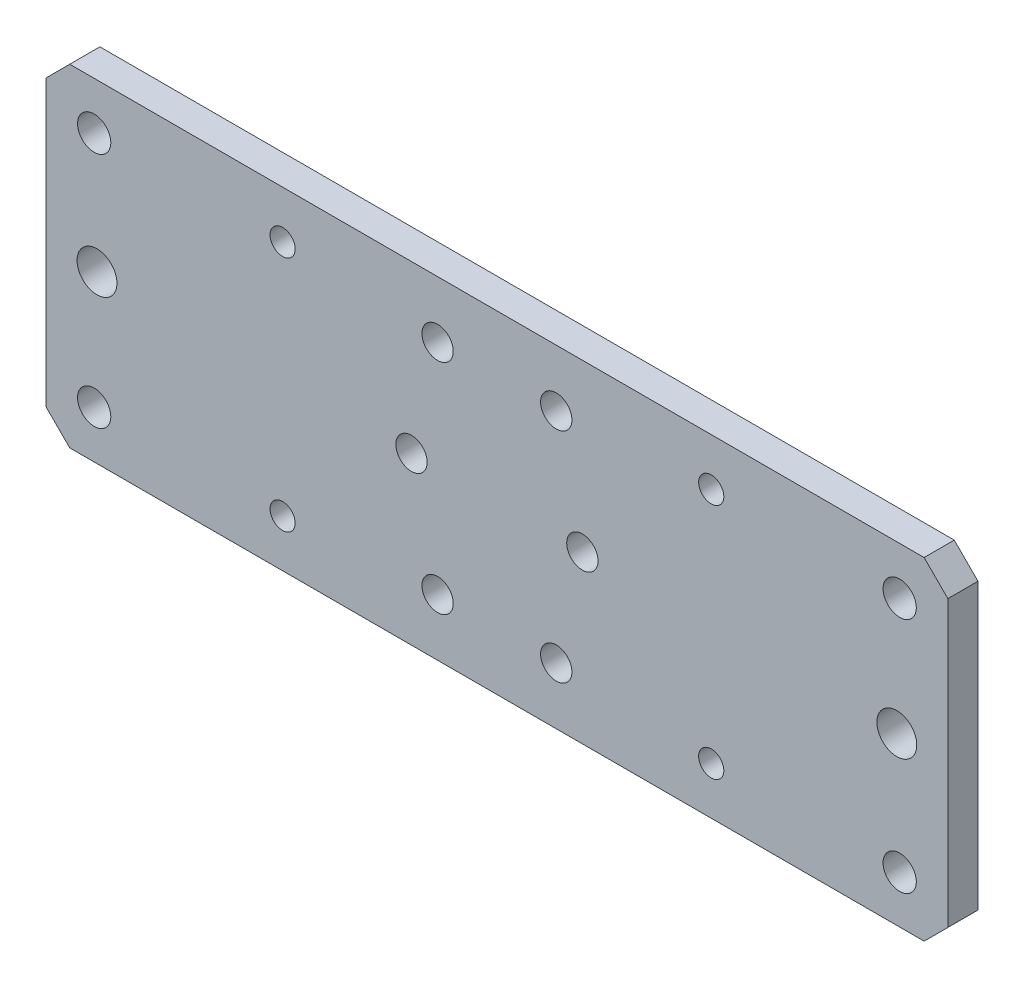
ISO-10303-21;
HEADER;
FILE_DESCRIPTION(('STEP AP214'),'2;1');
FILE_NAME('part.step','',(''),(''),'','','');
FILE_SCHEMA(('AUTOMOTIVE_DESIGN { 1 0 10303 214 1 1 1 1 }'));
ENDSEC;
DATA;
#1=APPLICATION_CONTEXT('core data for automotive mechanical design processes');
#2=APPLICATION_PROTOCOL_DEFINITION('international standard','automotive_design',2000,#1);
#3=PRODUCT_CONTEXT('',#1,'mechanical');
#4=PRODUCT('Part','Part','',(#3));
#5=PRODUCT_RELATED_PRODUCT_CATEGORY('part','',(#4));
#6=PRODUCT_DEFINITION_FORMATION('','',#4);
#7=PRODUCT_DEFINITION_CONTEXT('part definition',#1,'design');
#8=PRODUCT_DEFINITION('design','',#6,#7);
#9=PRODUCT_DEFINITION_SHAPE('','',#8);
#10=(LENGTH_UNIT() NAMED_UNIT(*) SI_UNIT(.MILLI.,.METRE.));
#11=(NAMED_UNIT(*) PLANE_ANGLE_UNIT() SI_UNIT($,.RADIAN.));
#12=(NAMED_UNIT(*) SI_UNIT($,.STERADIAN.) SOLID_ANGLE_UNIT());
#13=UNCERTAINTY_MEASURE_WITH_UNIT(LENGTH_MEASURE(1.E-05),#10,'distance_accuracy_value','');
#14=(GEOMETRIC_REPRESENTATION_CONTEXT(3) GLOBAL_UNCERTAINTY_ASSIGNED_CONTEXT((#13)) GLOBAL_UNIT_ASSIGNED_CONTEXT((#10,
#11,#12)) REPRESENTATION_CONTEXT('',''));
#15=CARTESIAN_POINT('',(0.,0.,0.));
#16=DIRECTION('',(0.,0.,1.));
#17=DIRECTION('',(1.,0.,0.));
#18=AXIS2_PLACEMENT_3D('',#15,#16,#17);
#19=CARTESIAN_POINT('',(0.,0.,17.4999999999999));
#20=DIRECTION('',(0.,0.,1.));
#21=DIRECTION('',(1.,0.,0.));
#22=AXIS2_PLACEMENT_3D('',#19,#20,#21);
#23=PLANE('',#22);
#24=CARTESIAN_POINT('',(84.8500000000001,-25.,17.4999999999999));
#25=DIRECTION('',(0.,0.,-1.));
#26=DIRECTION('',(-1.,0.,0.));
#27=AXIS2_PLACEMENT_3D('',#24,#25,#26);
#28=CIRCLE('',#27,3.5);
#29=CARTESIAN_POINT('',(81.3500000000001,-25.,17.4999999999999));
#30=VERTEX_POINT('',#29);
#31=EDGE_CURVE('E206',#30,#30,#28,.T.);
#32=ORIENTED_EDGE('',*,*,#31,.T.);
#33=EDGE_LOOP('',(#32));
#34=FACE_BOUND('',#33,.T.);
#35=CARTESIAN_POINT('',(-84.8500000000001,25.,17.4999999999999));
#36=DIRECTION('',(0.,0.,-1.));
#37=DIRECTION('',(-1.,0.,0.));
#38=AXIS2_PLACEMENT_3D('',#35,#36,#37);
#39=CIRCLE('',#38,3.5);
#40=CARTESIAN_POINT('',(-88.3500000000001,25.,17.4999999999999));
#41=VERTEX_POINT('',#40);
#42=EDGE_CURVE('E203',#41,#41,#39,.T.);
#43=ORIENTED_EDGE('',*,*,#42,.T.);
#44=EDGE_LOOP('',(#43));
#45=FACE_BOUND('',#44,.T.);
#46=CARTESIAN_POINT('',(-84.8500000000001,-25.,17.4999999999999));
#47=DIRECTION('',(0.,0.,-1.));
#48=DIRECTION('',(-1.,0.,0.));
#49=AXIS2_PLACEMENT_3D('',#46,#47,#48);
#50=CIRCLE('',#49,3.5);
#51=CARTESIAN_POINT('',(-88.3500000000001,-25.,17.4999999999999));
#52=VERTEX_POINT('',#51);
#53=EDGE_CURVE('E200',#52,#52,#50,.T.);
#54=ORIENTED_EDGE('',*,*,#53,.T.);
#55=EDGE_LOOP('',(#54));
#56=FACE_BOUND('',#55,.T.);
#57=CARTESIAN_POINT('',(84.8500000000001,25.,17.4999999999999));
#58=DIRECTION('',(0.,0.,-1.));
#59=DIRECTION('',(-1.,0.,0.));
#60=AXIS2_PLACEMENT_3D('',#57,#58,#59);
#61=CIRCLE('',#60,3.5);
#62=CARTESIAN_POINT('',(81.3500000000001,25.,17.4999999999999));
#63=VERTEX_POINT('',#62);
#64=EDGE_CURVE('E197',#63,#63,#61,.T.);
#65=ORIENTED_EDGE('',*,*,#64,.T.);
#66=EDGE_LOOP('',(#65));
#67=FACE_BOUND('',#66,.T.);
#68=CARTESIAN_POINT('',(84.25,0.,17.4999999999999));
#69=DIRECTION('',(0.,0.,-1.));
#70=DIRECTION('',(-1.,0.,0.));
#71=AXIS2_PLACEMENT_3D('',#68,#69,#70);
#72=CIRCLE('',#71,4.2);
#73=CARTESIAN_POINT('',(80.05,0.,17.4999999999999));
#74=VERTEX_POINT('',#73);
#75=EDGE_CURVE('E194',#74,#74,#72,.T.);
#76=ORIENTED_EDGE('',*,*,#75,.T.);
#77=EDGE_LOOP('',(#76));
#78=FACE_BOUND('',#77,.T.);
#79=CARTESIAN_POINT('',(-84.25,0.,17.4999999999999));
#80=DIRECTION('',(0.,0.,-1.));
#81=DIRECTION('',(-1.,0.,0.));
#82=AXIS2_PLACEMENT_3D('',#79,#80,#81);
#83=CIRCLE('',#82,4.2);
#84=CARTESIAN_POINT('',(-88.45,0.,17.4999999999999));
#85=VERTEX_POINT('',#84);
#86=EDGE_CURVE('E191',#85,#85,#83,.T.);
#87=ORIENTED_EDGE('',*,*,#86,.T.);
#88=EDGE_LOOP('',(#87));
#89=FACE_BOUND('',#88,.T.);
#90=CARTESIAN_POINT('',(45.1500000000001,-25.0000000000001,17.4999999999999));
#91=DIRECTION('',(0.,0.,-1.));
#92=DIRECTION('',(-1.,0.,0.));
#93=AXIS2_PLACEMENT_3D('',#90,#91,#92);
#94=CIRCLE('',#93,2.65);
#95=CARTESIAN_POINT('',(42.5000000000001,-25.0000000000001,17.4999999999999));
#96=VERTEX_POINT('',#95);
#97=EDGE_CURVE('E188',#96,#96,#94,.T.);
#98=ORIENTED_EDGE('',*,*,#97,.T.);
#99=EDGE_LOOP('',(#98));
#100=FACE_BOUND('',#99,.T.);
#101=CARTESIAN_POINT('',(-45.15,25.,17.4999999999999));
#102=DIRECTION('',(0.,0.,-1.));
#103=DIRECTION('',(-1.,0.,0.));
#104=AXIS2_PLACEMENT_3D('',#101,#102,#103);
#105=CIRCLE('',#104,2.65);
#106=CARTESIAN_POINT('',(-47.8,25.,17.4999999999999));
#107=VERTEX_POINT('',#106);
#108=EDGE_CURVE('E185',#107,#107,#105,.T.);
#109=ORIENTED_EDGE('',*,*,#108,.T.);
#110=EDGE_LOOP('',(#109));
#111=FACE_BOUND('',#110,.T.);
#112=CARTESIAN_POINT('',(-45.1500000000001,-25.0000000000001,17.4999999999999));
#113=DIRECTION('',(0.,0.,-1.));
#114=DIRECTION('',(-1.,0.,0.));
#115=AXIS2_PLACEMENT_3D('',#112,#113,#114);
#116=CIRCLE('',#115,2.65);
#117=CARTESIAN_POINT('',(-47.8000000000001,-25.0000000000001,17.4999999999999));
#118=VERTEX_POINT('',#117);
#119=EDGE_CURVE('E182',#118,#118,#116,.T.);
#120=ORIENTED_EDGE('',*,*,#119,.T.);
#121=EDGE_LOOP('',(#120));
#122=FACE_BOUND('',#121,.T.);
#123=CARTESIAN_POINT('',(45.15,25.,17.4999999999999));
#124=DIRECTION('',(0.,0.,-1.));
#125=DIRECTION('',(-1.,0.,0.));
#126=AXIS2_PLACEMENT_3D('',#123,#124,#125);
#127=CIRCLE('',#126,2.65);
#128=CARTESIAN_POINT('',(42.5,25.,17.4999999999999));
#129=VERTEX_POINT('',#128);
#130=EDGE_CURVE('E179',#129,#129,#127,.T.);
#131=ORIENTED_EDGE('',*,*,#130,.T.);
#132=EDGE_LOOP('',(#131));
#133=FACE_BOUND('',#132,.T.);
#134=CARTESIAN_POINT('',(12.5,-23.,17.4999999999999));
#135=DIRECTION('',(0.,0.,-1.));
#136=DIRECTION('',(-1.,0.,0.));
#137=AXIS2_PLACEMENT_3D('',#134,#135,#136);
#138=CIRCLE('',#137,3.3);
#139=CARTESIAN_POINT('',(9.2,-23.,17.4999999999999));
#140=VERTEX_POINT('',#139);
#141=EDGE_CURVE('E176',#140,#140,#138,.T.);
#142=ORIENTED_EDGE('',*,*,#141,.T.);
#143=EDGE_LOOP('',(#142));
#144=FACE_BOUND('',#143,.T.);
#145=CARTESIAN_POINT('',(12.5,23.,17.4999999999999));
#146=DIRECTION('',(0.,0.,-1.));
#147=DIRECTION('',(-1.,0.,0.));
#148=AXIS2_PLACEMENT_3D('',#145,#146,#147);
#149=CIRCLE('',#148,3.3);
#150=CARTESIAN_POINT('',(9.2,23.,17.4999999999999));
#151=VERTEX_POINT('',#150);
#152=EDGE_CURVE('E173',#151,#151,#149,.T.);
#153=ORIENTED_EDGE('',*,*,#152,.T.);
#154=EDGE_LOOP('',(#153));
#155=FACE_BOUND('',#154,.T.);
#156=CARTESIAN_POINT('',(-18.,0.,17.4999999999999));
#157=DIRECTION('',(0.,0.,-1.));
#158=DIRECTION('',(-1.,0.,0.));
#159=AXIS2_PLACEMENT_3D('',#156,#157,#158);
#160=CIRCLE('',#159,3.3);
#161=CARTESIAN_POINT('',(-21.3,0.,17.4999999999999));
#162=VERTEX_POINT('',#161);
#163=EDGE_CURVE('E170',#162,#162,#160,.T.);
#164=ORIENTED_EDGE('',*,*,#163,.T.);
#165=EDGE_LOOP('',(#164));
#166=FACE_BOUND('',#165,.T.);
#167=CARTESIAN_POINT('',(-12.5,-23.,17.4999999999999));
#168=DIRECTION('',(0.,0.,-1.));
#169=DIRECTION('',(-1.,0.,0.));
#170=AXIS2_PLACEMENT_3D('',#167,#168,#169);
#171=CIRCLE('',#170,3.3);
#172=CARTESIAN_POINT('',(-15.8,-23.,17.4999999999999));
#173=VERTEX_POINT('',#172);
#174=EDGE_CURVE('E167',#173,#173,#171,.T.);
#175=ORIENTED_EDGE('',*,*,#174,.T.);
#176=EDGE_LOOP('',(#175));
#177=FACE_BOUND('',#176,.T.);
#178=CARTESIAN_POINT('',(-12.5,23.,17.4999999999999));
#179=DIRECTION('',(0.,0.,-1.));
#180=DIRECTION('',(-1.,0.,0.));
#181=AXIS2_PLACEMENT_3D('',#178,#179,#180);
#182=CIRCLE('',#181,3.3);
#183=CARTESIAN_POINT('',(-15.8,23.,17.4999999999999));
#184=VERTEX_POINT('',#183);
#185=EDGE_CURVE('E164',#184,#184,#182,.T.);
#186=ORIENTED_EDGE('',*,*,#185,.T.);
#187=EDGE_LOOP('',(#186));
#188=FACE_BOUND('',#187,.T.);
#189=CARTESIAN_POINT('',(18.,0.,17.4999999999999));
#190=DIRECTION('',(0.,0.,-1.));
#191=DIRECTION('',(-1.,0.,0.));
#192=AXIS2_PLACEMENT_3D('',#189,#190,#191);
#193=CIRCLE('',#192,3.3);
#194=CARTESIAN_POINT('',(14.7,0.,17.4999999999999));
#195=VERTEX_POINT('',#194);
#196=EDGE_CURVE('E161',#195,#195,#193,.T.);
#197=ORIENTED_EDGE('',*,*,#196,.T.);
#198=EDGE_LOOP('',(#197));
#199=FACE_BOUND('',#198,.T.);
#200=DIRECTION('',(1.,0.,0.));
#201=VECTOR('',#200,1.);
#202=CARTESIAN_POINT('',(95.,34.9999999999998,17.4999999999999));
#203=LINE('',#202,#201);
#204=CARTESIAN_POINT('',(-90.,34.9999999999998,17.4999999999999));
#205=VERTEX_POINT('',#204);
#206=CARTESIAN_POINT('',(90.,34.9999999999998,17.4999999999999));
#207=VERTEX_POINT('',#206);
#208=EDGE_CURVE('E143',#205,#207,#203,.T.);
#209=ORIENTED_EDGE('',*,*,#208,.F.);
#210=DIRECTION('',(0.70710678118655,0.707106781186545,0.));
#211=VECTOR('',#210,1.);
#212=CARTESIAN_POINT('',(-62.4999999999996,62.5,17.4999999999999));
#213=LINE('',#212,#211);
#214=CARTESIAN_POINT('',(-95.,29.9999999999998,17.4999999999999));
#215=VERTEX_POINT('',#214);
#216=EDGE_CURVE('E114',#205,#215,#213,.F.);
#217=ORIENTED_EDGE('',*,*,#216,.T.);
#218=DIRECTION('',(0.,-1.,0.));
#219=VECTOR('',#218,1.);
#220=CARTESIAN_POINT('',(-95.,34.9999999999998,17.4999999999999));
#221=LINE('',#220,#219);
#222=CARTESIAN_POINT('',(-94.9999999999999,-29.9999999999997,17.4999999999999));
#223=VERTEX_POINT('',#222);
#224=EDGE_CURVE('E104',#223,#215,#221,.F.);
#225=ORIENTED_EDGE('',*,*,#224,.F.);
#226=DIRECTION('',(-0.707106781186546,0.707106781186549,0.));
#227=VECTOR('',#226,1.);
#228=CARTESIAN_POINT('',(-62.5000000000001,-62.4999999999998,17.4999999999999));
#229=LINE('',#228,#227);
#230=CARTESIAN_POINT('',(-89.9999999999999,-34.9999999999998,17.4999999999999));
#231=VERTEX_POINT('',#230);
#232=EDGE_CURVE('E48',#223,#231,#229,.F.);
#233=ORIENTED_EDGE('',*,*,#232,.T.);
#234=DIRECTION('',(1.,0.,0.));
#235=VECTOR('',#234,1.);
#236=CARTESIAN_POINT('',(-94.9999999999999,-34.9999999999998,17.4999999999999));
#237=LINE('',#236,#235);
#238=CARTESIAN_POINT('',(90.,-34.9999999999999,17.4999999999999));
#239=VERTEX_POINT('',#238);
#240=EDGE_CURVE('E115',#239,#231,#237,.F.);
#241=ORIENTED_EDGE('',*,*,#240,.F.);
#242=DIRECTION('',(-0.707106781186548,-0.707106781186547,0.));
#243=VECTOR('',#242,1.);
#244=CARTESIAN_POINT('',(62.4999999999998,-62.4999999999999,17.4999999999999));
#245=LINE('',#244,#243);
#246=CARTESIAN_POINT('',(95.,-29.9999999999999,17.4999999999999));
#247=VERTEX_POINT('',#246);
#248=EDGE_CURVE('E121',#239,#247,#245,.F.);
#249=ORIENTED_EDGE('',*,*,#248,.T.);
#250=DIRECTION('',(0.,1.,0.));
#251=VECTOR('',#250,1.);
#252=CARTESIAN_POINT('',(95.,-34.9999999999998,17.4999999999999));
#253=LINE('',#252,#251);
#254=CARTESIAN_POINT('',(95.,29.9999999999998,17.4999999999999));
#255=VERTEX_POINT('',#254);
#256=EDGE_CURVE('E135',#255,#247,#253,.F.);
#257=ORIENTED_EDGE('',*,*,#256,.F.);
#258=DIRECTION('',(0.707106781186546,-0.707106781186549,0.));
#259=VECTOR('',#258,1.);
#260=CARTESIAN_POINT('',(62.5000000000002,62.4999999999998,17.4999999999999));
#261=LINE('',#260,#259);
#262=EDGE_CURVE('E124',#255,#207,#261,.F.);
#263=ORIENTED_EDGE('',*,*,#262,.T.);
#264=EDGE_LOOP('',(#209,#217,#225,#233,#241,#249,#257,#263));
#265=FACE_BOUND('',#264,.T.);
#266=ADVANCED_FACE('F33',(#34,#45,#56,#67,#78,#89,#100,#111,#122,#133,#144,#155,#166,#177,#188,
#199,#265),#23,.T.);
#267=CARTESIAN_POINT('',(-95.,34.9999999999998,11.1499999999999));
#268=DIRECTION('',(-1.,0.,0.));
#269=DIRECTION('',(0.,-1.,0.));
#270=AXIS2_PLACEMENT_3D('',#267,#268,#269);
#271=PLANE('',#270);
#272=ORIENTED_EDGE('',*,*,#224,.T.);
#273=DIRECTION('',(0.,0.,-1.));
#274=VECTOR('',#273,1.);
#275=CARTESIAN_POINT('',(-95.,29.9999999999998,11.1499999999999));
#276=LINE('',#275,#274);
#277=CARTESIAN_POINT('',(-95.,29.9999999999998,11.1499999999999));
#278=VERTEX_POINT('',#277);
#279=EDGE_CURVE('E109',#215,#278,#276,.T.);
#280=ORIENTED_EDGE('',*,*,#279,.T.);
#281=DIRECTION('',(0.,1.,0.));
#282=VECTOR('',#281,1.);
#283=CARTESIAN_POINT('',(-95.,0.,11.1499999999999));
#284=LINE('',#283,#282);
#285=CARTESIAN_POINT('',(-95.,-29.9999999999997,11.1499999999999));
#286=VERTEX_POINT('',#285);
#287=EDGE_CURVE('E107',#278,#286,#284,.F.);
#288=ORIENTED_EDGE('',*,*,#287,.T.);
#289=DIRECTION('',(0.,0.,1.));
#290=VECTOR('',#289,1.);
#291=CARTESIAN_POINT('',(-94.9999999999999,-29.9999999999997,11.1499999999999));
#292=LINE('',#291,#290);
#293=EDGE_CURVE('E101',#286,#223,#292,.T.);
#294=ORIENTED_EDGE('',*,*,#293,.T.);
#295=EDGE_LOOP('',(#272,#280,#288,#294));
#296=FACE_BOUND('',#295,.T.);
#297=ADVANCED_FACE('F102',(#296),#271,.T.);
#298=CARTESIAN_POINT('',(-94.9999999999999,-34.9999999999998,11.1499999999999));
#299=DIRECTION('',(0.,-1.,0.));
#300=DIRECTION('',(1.,0.,0.));
#301=AXIS2_PLACEMENT_3D('',#298,#299,#300);
#302=PLANE('',#301);
#303=ORIENTED_EDGE('',*,*,#240,.T.);
#304=DIRECTION('',(0.,0.,-1.));
#305=VECTOR('',#304,1.);
#306=CARTESIAN_POINT('',(-89.9999999999999,-34.9999999999998,11.1499999999999));
#307=LINE('',#306,#305);
#308=CARTESIAN_POINT('',(-89.9999999999999,-34.9999999999998,11.1499999999999));
#309=VERTEX_POINT('',#308);
#310=EDGE_CURVE('E120',#231,#309,#307,.T.);
#311=ORIENTED_EDGE('',*,*,#310,.T.);
#312=DIRECTION('',(1.,0.,0.));
#313=VECTOR('',#312,1.);
#314=CARTESIAN_POINT('',(0.,-34.9999999999998,11.1499999999999));
#315=LINE('',#314,#313);
#316=CARTESIAN_POINT('',(90.,-34.9999999999998,11.1499999999999));
#317=VERTEX_POINT('',#316);
#318=EDGE_CURVE('E260',#309,#317,#315,.T.);
#319=ORIENTED_EDGE('',*,*,#318,.T.);
#320=DIRECTION('',(0.,0.,1.));
#321=VECTOR('',#320,1.);
#322=CARTESIAN_POINT('',(90.,-34.9999999999999,11.1499999999999));
#323=LINE('',#322,#321);
#324=EDGE_CURVE('E55',#317,#239,#323,.T.);
#325=ORIENTED_EDGE('',*,*,#324,.T.);
#326=EDGE_LOOP('',(#303,#311,#319,#325));
#327=FACE_BOUND('',#326,.T.);
#328=ADVANCED_FACE('F273',(#327),#302,.T.);
#329=CARTESIAN_POINT('',(95.,-34.9999999999998,11.1499999999999));
#330=DIRECTION('',(1.,0.,0.));
#331=DIRECTION('',(0.,1.,0.));
#332=AXIS2_PLACEMENT_3D('',#329,#330,#331);
#333=PLANE('',#332);
#334=ORIENTED_EDGE('',*,*,#256,.T.);
#335=DIRECTION('',(0.,0.,-1.));
#336=VECTOR('',#335,1.);
#337=CARTESIAN_POINT('',(95.,-29.9999999999999,11.1499999999999));
#338=LINE('',#337,#336);
#339=CARTESIAN_POINT('',(95.,-29.9999999999999,11.1499999999999));
#340=VERTEX_POINT('',#339);
#341=EDGE_CURVE('E11',#247,#340,#338,.T.);
#342=ORIENTED_EDGE('',*,*,#341,.T.);
#343=DIRECTION('',(0.,1.,0.));
#344=VECTOR('',#343,1.);
#345=CARTESIAN_POINT('',(95.,0.,11.1499999999999));
#346=LINE('',#345,#344);
#347=CARTESIAN_POINT('',(95.,29.9999999999998,11.1499999999999));
#348=VERTEX_POINT('',#347);
#349=EDGE_CURVE('E138',#340,#348,#346,.T.);
#350=ORIENTED_EDGE('',*,*,#349,.T.);
#351=DIRECTION('',(0.,0.,1.));
#352=VECTOR('',#351,1.);
#353=CARTESIAN_POINT('',(95.,29.9999999999998,11.1499999999999));
#354=LINE('',#353,#352);
#355=EDGE_CURVE('E41',#348,#255,#354,.T.);
#356=ORIENTED_EDGE('',*,*,#355,.T.);
#357=EDGE_LOOP('',(#334,#342,#350,#356));
#358=FACE_BOUND('',#357,.T.);
#359=ADVANCED_FACE('F134',(#358),#333,.T.);
#360=CARTESIAN_POINT('',(95.,34.9999999999998,11.1499999999999));
#361=DIRECTION('',(0.,1.,0.));
#362=DIRECTION('',(0.,0.,1.));
#363=AXIS2_PLACEMENT_3D('',#360,#361,#362);
#364=PLANE('',#363);
#365=DIRECTION('',(1.,0.,0.));
#366=VECTOR('',#365,1.);
#367=CARTESIAN_POINT('',(0.,34.9999999999998,11.1499999999999));
#368=LINE('',#367,#366);
#369=CARTESIAN_POINT('',(90.,34.9999999999998,11.1499999999999));
#370=VERTEX_POINT('',#369);
#371=CARTESIAN_POINT('',(-90.,34.9999999999998,11.1499999999999));
#372=VERTEX_POINT('',#371);
#373=EDGE_CURVE('E213',#370,#372,#368,.F.);
#374=ORIENTED_EDGE('',*,*,#373,.T.);
#375=DIRECTION('',(0.,0.,1.));
#376=VECTOR('',#375,1.);
#377=CARTESIAN_POINT('',(-90.,34.9999999999998,11.1499999999999));
#378=LINE('',#377,#376);
#379=EDGE_CURVE('E148',#372,#205,#378,.T.);
#380=ORIENTED_EDGE('',*,*,#379,.T.);
#381=ORIENTED_EDGE('',*,*,#208,.T.);
#382=DIRECTION('',(0.,0.,-1.));
#383=VECTOR('',#382,1.);
#384=CARTESIAN_POINT('',(90.,34.9999999999998,11.1499999999999));
#385=LINE('',#384,#383);
#386=EDGE_CURVE('E147',#207,#370,#385,.T.);
#387=ORIENTED_EDGE('',*,*,#386,.T.);
#388=EDGE_LOOP('',(#374,#380,#381,#387));
#389=FACE_BOUND('',#388,.T.);
#390=ADVANCED_FACE('F267',(#389),#364,.T.);
#391=CARTESIAN_POINT('',(18.,0.,14.3249999999999));
#392=DIRECTION('',(0.,0.,-1.));
#393=DIRECTION('',(-1.,0.,0.));
#394=AXIS2_PLACEMENT_3D('',#391,#392,#393);
#395=CYLINDRICAL_SURFACE('',#394,3.3);
#396=CARTESIAN_POINT('',(18.,0.,11.1499999999999));
#397=DIRECTION('',(0.,0.,-1.));
#398=DIRECTION('',(-1.,0.,0.));
#399=AXIS2_PLACEMENT_3D('',#396,#397,#398);
#400=CIRCLE('',#399,3.3);
#401=CARTESIAN_POINT('',(14.7,0.,11.1499999999999));
#402=VERTEX_POINT('',#401);
#403=EDGE_CURVE('E209',#402,#402,#400,.T.);
#404=ORIENTED_EDGE('',*,*,#403,.T.);
#405=EDGE_LOOP('',(#404));
#406=FACE_BOUND('',#405,.T.);
#407=ORIENTED_EDGE('',*,*,#196,.F.);
#408=EDGE_LOOP('',(#407));
#409=FACE_BOUND('',#408,.T.);
#410=ADVANCED_FACE('F353',(#406,#409),#395,.F.);
#411=CARTESIAN_POINT('',(-12.5,23.,14.3249999999999));
#412=DIRECTION('',(0.,0.,-1.));
#413=DIRECTION('',(-1.,0.,0.));
#414=AXIS2_PLACEMENT_3D('',#411,#412,#413);
#415=CYLINDRICAL_SURFACE('',#414,3.3);
#416=CARTESIAN_POINT('',(-12.5,23.,11.1499999999999));
#417=DIRECTION('',(0.,0.,-1.));
#418=DIRECTION('',(-1.,0.,0.));
#419=AXIS2_PLACEMENT_3D('',#416,#417,#418);
#420=CIRCLE('',#419,3.3);
#421=CARTESIAN_POINT('',(-15.8,23.,11.1499999999999));
#422=VERTEX_POINT('',#421);
#423=EDGE_CURVE('E212',#422,#422,#420,.T.);
#424=ORIENTED_EDGE('',*,*,#423,.T.);
#425=EDGE_LOOP('',(#424));
#426=FACE_BOUND('',#425,.T.);
#427=ORIENTED_EDGE('',*,*,#185,.F.);
#428=EDGE_LOOP('',(#427));
#429=FACE_BOUND('',#428,.T.);
#430=ADVANCED_FACE('F349',(#426,#429),#415,.F.);
#431=CARTESIAN_POINT('',(-12.5,-23.,14.3249999999999));
#432=DIRECTION('',(0.,0.,-1.));
#433=DIRECTION('',(-1.,0.,0.));
#434=AXIS2_PLACEMENT_3D('',#431,#432,#433);
#435=CYLINDRICAL_SURFACE('',#434,3.3);
#436=CARTESIAN_POINT('',(-12.5,-23.,11.1499999999999));
#437=DIRECTION('',(0.,0.,-1.));
#438=DIRECTION('',(-1.,0.,0.));
#439=AXIS2_PLACEMENT_3D('',#436,#437,#438);
#440=CIRCLE('',#439,3.3);
#441=CARTESIAN_POINT('',(-15.8,-23.,11.1499999999999));
#442=VERTEX_POINT('',#441);
#443=EDGE_CURVE('E216',#442,#442,#440,.T.);
#444=ORIENTED_EDGE('',*,*,#443,.T.);
#445=EDGE_LOOP('',(#444));
#446=FACE_BOUND('',#445,.T.);
#447=ORIENTED_EDGE('',*,*,#174,.F.);
#448=EDGE_LOOP('',(#447));
#449=FACE_BOUND('',#448,.T.);
#450=ADVANCED_FACE('F345',(#446,#449),#435,.F.);
#451=CARTESIAN_POINT('',(-18.,0.,14.3249999999999));
#452=DIRECTION('',(0.,0.,-1.));
#453=DIRECTION('',(-1.,0.,0.));
#454=AXIS2_PLACEMENT_3D('',#451,#452,#453);
#455=CYLINDRICAL_SURFACE('',#454,3.3);
#456=CARTESIAN_POINT('',(-18.,0.,11.1499999999999));
#457=DIRECTION('',(0.,0.,-1.));
#458=DIRECTION('',(-1.,0.,0.));
#459=AXIS2_PLACEMENT_3D('',#456,#457,#458);
#460=CIRCLE('',#459,3.3);
#461=CARTESIAN_POINT('',(-21.3,0.,11.1499999999999));
#462=VERTEX_POINT('',#461);
#463=EDGE_CURVE('E219',#462,#462,#460,.T.);
#464=ORIENTED_EDGE('',*,*,#463,.T.);
#465=EDGE_LOOP('',(#464));
#466=FACE_BOUND('',#465,.T.);
#467=ORIENTED_EDGE('',*,*,#163,.F.);
#468=EDGE_LOOP('',(#467));
#469=FACE_BOUND('',#468,.T.);
#470=ADVANCED_FACE('F341',(#466,#469),#455,.F.);
#471=CARTESIAN_POINT('',(12.5,23.,14.3249999999999));
#472=DIRECTION('',(0.,0.,-1.));
#473=DIRECTION('',(-1.,0.,0.));
#474=AXIS2_PLACEMENT_3D('',#471,#472,#473);
#475=CYLINDRICAL_SURFACE('',#474,3.3);
#476=CARTESIAN_POINT('',(12.5,23.,11.1499999999999));
#477=DIRECTION('',(0.,0.,-1.));
#478=DIRECTION('',(-1.,0.,0.));
#479=AXIS2_PLACEMENT_3D('',#476,#477,#478);
#480=CIRCLE('',#479,3.3);
#481=CARTESIAN_POINT('',(9.2,23.,11.1499999999999));
#482=VERTEX_POINT('',#481);
#483=EDGE_CURVE('E222',#482,#482,#480,.T.);
#484=ORIENTED_EDGE('',*,*,#483,.T.);
#485=EDGE_LOOP('',(#484));
#486=FACE_BOUND('',#485,.T.);
#487=ORIENTED_EDGE('',*,*,#152,.F.);
#488=EDGE_LOOP('',(#487));
#489=FACE_BOUND('',#488,.T.);
#490=ADVANCED_FACE('F337',(#486,#489),#475,.F.);
#491=CARTESIAN_POINT('',(12.5,-23.,14.3249999999999));
#492=DIRECTION('',(0.,0.,-1.));
#493=DIRECTION('',(-1.,0.,0.));
#494=AXIS2_PLACEMENT_3D('',#491,#492,#493);
#495=CYLINDRICAL_SURFACE('',#494,3.3);
#496=CARTESIAN_POINT('',(12.5,-23.,11.1499999999999));
#497=DIRECTION('',(0.,0.,-1.));
#498=DIRECTION('',(-1.,0.,0.));
#499=AXIS2_PLACEMENT_3D('',#496,#497,#498);
#500=CIRCLE('',#499,3.3);
#501=CARTESIAN_POINT('',(9.2,-23.,11.1499999999999));
#502=VERTEX_POINT('',#501);
#503=EDGE_CURVE('E225',#502,#502,#500,.T.);
#504=ORIENTED_EDGE('',*,*,#503,.T.);
#505=EDGE_LOOP('',(#504));
#506=FACE_BOUND('',#505,.T.);
#507=ORIENTED_EDGE('',*,*,#141,.F.);
#508=EDGE_LOOP('',(#507));
#509=FACE_BOUND('',#508,.T.);
#510=ADVANCED_FACE('F333',(#506,#509),#495,.F.);
#511=CARTESIAN_POINT('',(45.15,25.,14.0074999999999));
#512=DIRECTION('',(0.,0.,-1.));
#513=DIRECTION('',(-1.,0.,0.));
#514=AXIS2_PLACEMENT_3D('',#511,#512,#513);
#515=CYLINDRICAL_SURFACE('',#514,2.65);
#516=CARTESIAN_POINT('',(45.15,25.,11.1499999999999));
#517=DIRECTION('',(0.,0.,-1.));
#518=DIRECTION('',(-1.,0.,0.));
#519=AXIS2_PLACEMENT_3D('',#516,#517,#518);
#520=CIRCLE('',#519,2.65);
#521=CARTESIAN_POINT('',(42.5,25.,11.1499999999999));
#522=VERTEX_POINT('',#521);
#523=EDGE_CURVE('E228',#522,#522,#520,.T.);
#524=ORIENTED_EDGE('',*,*,#523,.T.);
#525=EDGE_LOOP('',(#524));
#526=FACE_BOUND('',#525,.T.);
#527=ORIENTED_EDGE('',*,*,#130,.F.);
#528=EDGE_LOOP('',(#527));
#529=FACE_BOUND('',#528,.T.);
#530=ADVANCED_FACE('F329',(#526,#529),#515,.F.);
#531=CARTESIAN_POINT('',(-45.1500000000001,-25.0000000000001,14.0074999999999));
#532=DIRECTION('',(0.,0.,-1.));
#533=DIRECTION('',(-1.,0.,0.));
#534=AXIS2_PLACEMENT_3D('',#531,#532,#533);
#535=CYLINDRICAL_SURFACE('',#534,2.65);
#536=CARTESIAN_POINT('',(-45.1500000000001,-25.0000000000001,11.1499999999999));
#537=DIRECTION('',(0.,0.,-1.));
#538=DIRECTION('',(-1.,0.,0.));
#539=AXIS2_PLACEMENT_3D('',#536,#537,#538);
#540=CIRCLE('',#539,2.65);
#541=CARTESIAN_POINT('',(-47.8000000000001,-25.0000000000001,11.1499999999999));
#542=VERTEX_POINT('',#541);
#543=EDGE_CURVE('E231',#542,#542,#540,.T.);
#544=ORIENTED_EDGE('',*,*,#543,.T.);
#545=EDGE_LOOP('',(#544));
#546=FACE_BOUND('',#545,.T.);
#547=ORIENTED_EDGE('',*,*,#119,.F.);
#548=EDGE_LOOP('',(#547));
#549=FACE_BOUND('',#548,.T.);
#550=ADVANCED_FACE('F325',(#546,#549),#535,.F.);
#551=CARTESIAN_POINT('',(-45.15,25.,14.0074999999999));
#552=DIRECTION('',(0.,0.,-1.));
#553=DIRECTION('',(-1.,0.,0.));
#554=AXIS2_PLACEMENT_3D('',#551,#552,#553);
#555=CYLINDRICAL_SURFACE('',#554,2.65);
#556=CARTESIAN_POINT('',(-45.15,25.,11.1499999999999));
#557=DIRECTION('',(0.,0.,-1.));
#558=DIRECTION('',(-1.,0.,0.));
#559=AXIS2_PLACEMENT_3D('',#556,#557,#558);
#560=CIRCLE('',#559,2.65);
#561=CARTESIAN_POINT('',(-47.8,25.,11.1499999999999));
#562=VERTEX_POINT('',#561);
#563=EDGE_CURVE('E234',#562,#562,#560,.T.);
#564=ORIENTED_EDGE('',*,*,#563,.T.);
#565=EDGE_LOOP('',(#564));
#566=FACE_BOUND('',#565,.T.);
#567=ORIENTED_EDGE('',*,*,#108,.F.);
#568=EDGE_LOOP('',(#567));
#569=FACE_BOUND('',#568,.T.);
#570=ADVANCED_FACE('F321',(#566,#569),#555,.F.);
#571=CARTESIAN_POINT('',(45.1500000000001,-25.0000000000001,14.0074999999999));
#572=DIRECTION('',(0.,0.,-1.));
#573=DIRECTION('',(-1.,0.,0.));
#574=AXIS2_PLACEMENT_3D('',#571,#572,#573);
#575=CYLINDRICAL_SURFACE('',#574,2.65);
#576=CARTESIAN_POINT('',(45.1500000000001,-25.0000000000001,11.1499999999999));
#577=DIRECTION('',(0.,0.,-1.));
#578=DIRECTION('',(-1.,0.,0.));
#579=AXIS2_PLACEMENT_3D('',#576,#577,#578);
#580=CIRCLE('',#579,2.65);
#581=CARTESIAN_POINT('',(42.5000000000001,-25.0000000000001,11.1499999999999));
#582=VERTEX_POINT('',#581);
#583=EDGE_CURVE('E237',#582,#582,#580,.T.);
#584=ORIENTED_EDGE('',*,*,#583,.T.);
#585=EDGE_LOOP('',(#584));
#586=FACE_BOUND('',#585,.T.);
#587=ORIENTED_EDGE('',*,*,#97,.F.);
#588=EDGE_LOOP('',(#587));
#589=FACE_BOUND('',#588,.T.);
#590=ADVANCED_FACE('F317',(#586,#589),#575,.F.);
#591=CARTESIAN_POINT('',(-84.25,0.,14.3249999999999));
#592=DIRECTION('',(0.,0.,-1.));
#593=DIRECTION('',(-1.,0.,0.));
#594=AXIS2_PLACEMENT_3D('',#591,#592,#593);
#595=CYLINDRICAL_SURFACE('',#594,4.2);
#596=CARTESIAN_POINT('',(-84.25,0.,11.1499999999999));
#597=DIRECTION('',(0.,0.,-1.));
#598=DIRECTION('',(-1.,0.,0.));
#599=AXIS2_PLACEMENT_3D('',#596,#597,#598);
#600=CIRCLE('',#599,4.2);
#601=CARTESIAN_POINT('',(-88.45,0.,11.1499999999999));
#602=VERTEX_POINT('',#601);
#603=EDGE_CURVE('E240',#602,#602,#600,.T.);
#604=ORIENTED_EDGE('',*,*,#603,.T.);
#605=EDGE_LOOP('',(#604));
#606=FACE_BOUND('',#605,.T.);
#607=ORIENTED_EDGE('',*,*,#86,.F.);
#608=EDGE_LOOP('',(#607));
#609=FACE_BOUND('',#608,.T.);
#610=ADVANCED_FACE('F313',(#606,#609),#595,.F.);
#611=CARTESIAN_POINT('',(84.25,0.,14.3249999999999));
#612=DIRECTION('',(0.,0.,-1.));
#613=DIRECTION('',(-1.,0.,0.));
#614=AXIS2_PLACEMENT_3D('',#611,#612,#613);
#615=CYLINDRICAL_SURFACE('',#614,4.2);
#616=CARTESIAN_POINT('',(84.25,0.,11.1499999999999));
#617=DIRECTION('',(0.,0.,-1.));
#618=DIRECTION('',(-1.,0.,0.));
#619=AXIS2_PLACEMENT_3D('',#616,#617,#618);
#620=CIRCLE('',#619,4.2);
#621=CARTESIAN_POINT('',(80.05,0.,11.1499999999999));
#622=VERTEX_POINT('',#621);
#623=EDGE_CURVE('E243',#622,#622,#620,.T.);
#624=ORIENTED_EDGE('',*,*,#623,.T.);
#625=EDGE_LOOP('',(#624));
#626=FACE_BOUND('',#625,.T.);
#627=ORIENTED_EDGE('',*,*,#75,.F.);
#628=EDGE_LOOP('',(#627));
#629=FACE_BOUND('',#628,.T.);
#630=ADVANCED_FACE('F309',(#626,#629),#615,.F.);
#631=CARTESIAN_POINT('',(84.8500000000001,25.,14.0074999999999));
#632=DIRECTION('',(0.,0.,-1.));
#633=DIRECTION('',(-1.,0.,0.));
#634=AXIS2_PLACEMENT_3D('',#631,#632,#633);
#635=CYLINDRICAL_SURFACE('',#634,3.5);
#636=CARTESIAN_POINT('',(84.8500000000001,25.,11.1499999999999));
#637=DIRECTION('',(0.,0.,-1.));
#638=DIRECTION('',(-1.,0.,0.));
#639=AXIS2_PLACEMENT_3D('',#636,#637,#638);
#640=CIRCLE('',#639,3.5);
#641=CARTESIAN_POINT('',(81.3500000000001,25.,11.1499999999999));
#642=VERTEX_POINT('',#641);
#643=EDGE_CURVE('E246',#642,#642,#640,.T.);
#644=ORIENTED_EDGE('',*,*,#643,.T.);
#645=EDGE_LOOP('',(#644));
#646=FACE_BOUND('',#645,.T.);
#647=ORIENTED_EDGE('',*,*,#64,.F.);
#648=EDGE_LOOP('',(#647));
#649=FACE_BOUND('',#648,.T.);
#650=ADVANCED_FACE('F305',(#646,#649),#635,.F.);
#651=CARTESIAN_POINT('',(-84.8500000000001,-25.,14.0074999999999));
#652=DIRECTION('',(0.,0.,-1.));
#653=DIRECTION('',(-1.,0.,0.));
#654=AXIS2_PLACEMENT_3D('',#651,#652,#653);
#655=CYLINDRICAL_SURFACE('',#654,3.5);
#656=CARTESIAN_POINT('',(-84.8500000000001,-25.,11.1499999999999));
#657=DIRECTION('',(0.,0.,-1.));
#658=DIRECTION('',(-1.,0.,0.));
#659=AXIS2_PLACEMENT_3D('',#656,#657,#658);
#660=CIRCLE('',#659,3.5);
#661=CARTESIAN_POINT('',(-88.3500000000001,-25.,11.1499999999999));
#662=VERTEX_POINT('',#661);
#663=EDGE_CURVE('E249',#662,#662,#660,.T.);
#664=ORIENTED_EDGE('',*,*,#663,.T.);
#665=EDGE_LOOP('',(#664));
#666=FACE_BOUND('',#665,.T.);
#667=ORIENTED_EDGE('',*,*,#53,.F.);
#668=EDGE_LOOP('',(#667));
#669=FACE_BOUND('',#668,.T.);
#670=ADVANCED_FACE('F301',(#666,#669),#655,.F.);
#671=CARTESIAN_POINT('',(-84.8500000000001,25.,14.0074999999999));
#672=DIRECTION('',(0.,0.,-1.));
#673=DIRECTION('',(-1.,0.,0.));
#674=AXIS2_PLACEMENT_3D('',#671,#672,#673);
#675=CYLINDRICAL_SURFACE('',#674,3.5);
#676=CARTESIAN_POINT('',(-84.8500000000001,25.,11.1499999999999));
#677=DIRECTION('',(0.,0.,-1.));
#678=DIRECTION('',(-1.,0.,0.));
#679=AXIS2_PLACEMENT_3D('',#676,#677,#678);
#680=CIRCLE('',#679,3.5);
#681=CARTESIAN_POINT('',(-88.3500000000001,25.,11.1499999999999));
#682=VERTEX_POINT('',#681);
#683=EDGE_CURVE('E252',#682,#682,#680,.T.);
#684=ORIENTED_EDGE('',*,*,#683,.T.);
#685=EDGE_LOOP('',(#684));
#686=FACE_BOUND('',#685,.T.);
#687=ORIENTED_EDGE('',*,*,#42,.F.);
#688=EDGE_LOOP('',(#687));
#689=FACE_BOUND('',#688,.T.);
#690=ADVANCED_FACE('F293',(#686,#689),#675,.F.);
#691=CARTESIAN_POINT('',(84.8500000000001,-25.,14.0074999999999));
#692=DIRECTION('',(0.,0.,-1.));
#693=DIRECTION('',(-1.,0.,0.));
#694=AXIS2_PLACEMENT_3D('',#691,#692,#693);
#695=CYLINDRICAL_SURFACE('',#694,3.5);
#696=CARTESIAN_POINT('',(84.8500000000001,-25.,11.1499999999999));
#697=DIRECTION('',(0.,0.,-1.));
#698=DIRECTION('',(-1.,0.,0.));
#699=AXIS2_PLACEMENT_3D('',#696,#697,#698);
#700=CIRCLE('',#699,3.5);
#701=CARTESIAN_POINT('',(81.3500000000001,-25.,11.1499999999999));
#702=VERTEX_POINT('',#701);
#703=EDGE_CURVE('E110',#702,#702,#700,.T.);
#704=ORIENTED_EDGE('',*,*,#703,.T.);
#705=EDGE_LOOP('',(#704));
#706=FACE_BOUND('',#705,.T.);
#707=ORIENTED_EDGE('',*,*,#31,.F.);
#708=EDGE_LOOP('',(#707));
#709=FACE_BOUND('',#708,.T.);
#710=ADVANCED_FACE('F283',(#706,#709),#695,.F.);
#711=CARTESIAN_POINT('',(0.,0.,11.1499999999999));
#712=DIRECTION('',(0.,0.,1.));
#713=DIRECTION('',(1.,0.,0.));
#714=AXIS2_PLACEMENT_3D('',#711,#712,#713);
#715=PLANE('',#714);
#716=ORIENTED_EDGE('',*,*,#703,.F.);
#717=EDGE_LOOP('',(#716));
#718=FACE_BOUND('',#717,.T.);
#719=ORIENTED_EDGE('',*,*,#683,.F.);
#720=EDGE_LOOP('',(#719));
#721=FACE_BOUND('',#720,.T.);
#722=ORIENTED_EDGE('',*,*,#663,.F.);
#723=EDGE_LOOP('',(#722));
#724=FACE_BOUND('',#723,.T.);
#725=ORIENTED_EDGE('',*,*,#643,.F.);
#726=EDGE_LOOP('',(#725));
#727=FACE_BOUND('',#726,.T.);
#728=ORIENTED_EDGE('',*,*,#623,.F.);
#729=EDGE_LOOP('',(#728));
#730=FACE_BOUND('',#729,.T.);
#731=ORIENTED_EDGE('',*,*,#603,.F.);
#732=EDGE_LOOP('',(#731));
#733=FACE_BOUND('',#732,.T.);
#734=ORIENTED_EDGE('',*,*,#583,.F.);
#735=EDGE_LOOP('',(#734));
#736=FACE_BOUND('',#735,.T.);
#737=ORIENTED_EDGE('',*,*,#563,.F.);
#738=EDGE_LOOP('',(#737));
#739=FACE_BOUND('',#738,.T.);
#740=ORIENTED_EDGE('',*,*,#543,.F.);
#741=EDGE_LOOP('',(#740));
#742=FACE_BOUND('',#741,.T.);
#743=ORIENTED_EDGE('',*,*,#523,.F.);
#744=EDGE_LOOP('',(#743));
#745=FACE_BOUND('',#744,.T.);
#746=ORIENTED_EDGE('',*,*,#503,.F.);
#747=EDGE_LOOP('',(#746));
#748=FACE_BOUND('',#747,.T.);
#749=ORIENTED_EDGE('',*,*,#483,.F.);
#750=EDGE_LOOP('',(#749));
#751=FACE_BOUND('',#750,.T.);
#752=ORIENTED_EDGE('',*,*,#463,.F.);
#753=EDGE_LOOP('',(#752));
#754=FACE_BOUND('',#753,.T.);
#755=ORIENTED_EDGE('',*,*,#443,.F.);
#756=EDGE_LOOP('',(#755));
#757=FACE_BOUND('',#756,.T.);
#758=ORIENTED_EDGE('',*,*,#423,.F.);
#759=EDGE_LOOP('',(#758));
#760=FACE_BOUND('',#759,.T.);
#761=ORIENTED_EDGE('',*,*,#403,.F.);
#762=EDGE_LOOP('',(#761));
#763=FACE_BOUND('',#762,.T.);
#764=ORIENTED_EDGE('',*,*,#287,.F.);
#765=DIRECTION('',(-0.70710678118655,-0.707106781186545,0.));
#766=VECTOR('',#765,1.);
#767=CARTESIAN_POINT('',(-95.,29.9999999999998,11.1499999999999));
#768=LINE('',#767,#766);
#769=EDGE_CURVE('E152',#278,#372,#768,.F.);
#770=ORIENTED_EDGE('',*,*,#769,.T.);
#771=ORIENTED_EDGE('',*,*,#373,.F.);
#772=DIRECTION('',(-0.707106781186546,0.707106781186549,0.));
#773=VECTOR('',#772,1.);
#774=CARTESIAN_POINT('',(90.,34.9999999999998,11.1499999999999));
#775=LINE('',#774,#773);
#776=EDGE_CURVE('E158',#370,#348,#775,.F.);
#777=ORIENTED_EDGE('',*,*,#776,.T.);
#778=ORIENTED_EDGE('',*,*,#349,.F.);
#779=DIRECTION('',(0.707106781186548,0.707106781186547,0.));
#780=VECTOR('',#779,1.);
#781=CARTESIAN_POINT('',(95.,-29.9999999999999,11.1499999999999));
#782=LINE('',#781,#780);
#783=EDGE_CURVE('E156',#340,#317,#782,.F.);
#784=ORIENTED_EDGE('',*,*,#783,.T.);
#785=ORIENTED_EDGE('',*,*,#318,.F.);
#786=DIRECTION('',(0.707106781186546,-0.707106781186549,0.));
#787=VECTOR('',#786,1.);
#788=CARTESIAN_POINT('',(-89.9999999999999,-34.9999999999998,11.1499999999999));
#789=LINE('',#788,#787);
#790=EDGE_CURVE('E154',#309,#286,#789,.F.);
#791=ORIENTED_EDGE('',*,*,#790,.T.);
#792=EDGE_LOOP('',(#764,#770,#771,#777,#778,#784,#785,#791));
#793=FACE_BOUND('',#792,.T.);
#794=ADVANCED_FACE('F271',(#718,#721,#724,#727,#730,#733,#736,#739,#742,#745,#748,#751,#754,
#757,#760,#763,#793),#715,.F.);
#795=CARTESIAN_POINT('',(-95.,29.9999999999998,11.1499999999999));
#796=DIRECTION('',(0.707106781186545,-0.70710678118655,0.));
#797=DIRECTION('',(0.,0.,-1.));
#798=AXIS2_PLACEMENT_3D('',#795,#796,#797);
#799=PLANE('',#798);
#800=ORIENTED_EDGE('',*,*,#216,.F.);
#801=ORIENTED_EDGE('',*,*,#379,.F.);
#802=ORIENTED_EDGE('',*,*,#769,.F.);
#803=ORIENTED_EDGE('',*,*,#279,.F.);
#804=EDGE_LOOP('',(#800,#801,#802,#803));
#805=FACE_BOUND('',#804,.T.);
#806=ADVANCED_FACE('F270',(#805),#799,.F.);
#807=CARTESIAN_POINT('',(-89.9999999999999,-34.9999999999998,11.1499999999999));
#808=DIRECTION('',(0.707106781186549,0.707106781186546,0.));
#809=DIRECTION('',(0.,0.,-1.));
#810=AXIS2_PLACEMENT_3D('',#807,#808,#809);
#811=PLANE('',#810);
#812=ORIENTED_EDGE('',*,*,#232,.F.);
#813=ORIENTED_EDGE('',*,*,#293,.F.);
#814=ORIENTED_EDGE('',*,*,#790,.F.);
#815=ORIENTED_EDGE('',*,*,#310,.F.);
#816=EDGE_LOOP('',(#812,#813,#814,#815));
#817=FACE_BOUND('',#816,.T.);
#818=ADVANCED_FACE('F118',(#817),#811,.F.);
#819=CARTESIAN_POINT('',(95.,-29.9999999999999,11.1499999999999));
#820=DIRECTION('',(-0.707106781186547,0.707106781186548,0.));
#821=DIRECTION('',(0.,0.,-1.));
#822=AXIS2_PLACEMENT_3D('',#819,#820,#821);
#823=PLANE('',#822);
#824=ORIENTED_EDGE('',*,*,#248,.F.);
#825=ORIENTED_EDGE('',*,*,#324,.F.);
#826=ORIENTED_EDGE('',*,*,#783,.F.);
#827=ORIENTED_EDGE('',*,*,#341,.F.);
#828=EDGE_LOOP('',(#824,#825,#826,#827));
#829=FACE_BOUND('',#828,.T.);
#830=ADVANCED_FACE('F275',(#829),#823,.F.);
#831=CARTESIAN_POINT('',(90.,34.9999999999998,11.1499999999999));
#832=DIRECTION('',(-0.707106781186549,-0.707106781186545,0.));
#833=DIRECTION('',(0.,0.,-1.));
#834=AXIS2_PLACEMENT_3D('',#831,#832,#833);
#835=PLANE('',#834);
#836=ORIENTED_EDGE('',*,*,#262,.F.);
#837=ORIENTED_EDGE('',*,*,#355,.F.);
#838=ORIENTED_EDGE('',*,*,#776,.F.);
#839=ORIENTED_EDGE('',*,*,#386,.F.);
#840=EDGE_LOOP('',(#836,#837,#838,#839));
#841=FACE_BOUND('',#840,.T.);
#842=ADVANCED_FACE('F35',(#841),#835,.F.);
#843=CLOSED_SHELL('',(#266,#297,#328,#359,#390,#410,#430,#450,#470,#490,#510,#530,#550,#570,
#590,#610,#630,#650,#670,#690,#710,#794,#806,#818,#830,#842));
#844=MANIFOLD_SOLID_BREP('B2',#843);
#845=ADVANCED_BREP_SHAPE_REPRESENTATION('',(#18,#844),#14);
#846=SHAPE_DEFINITION_REPRESENTATION(#9,#845);
ENDSEC;
END-ISO-10303-21;
